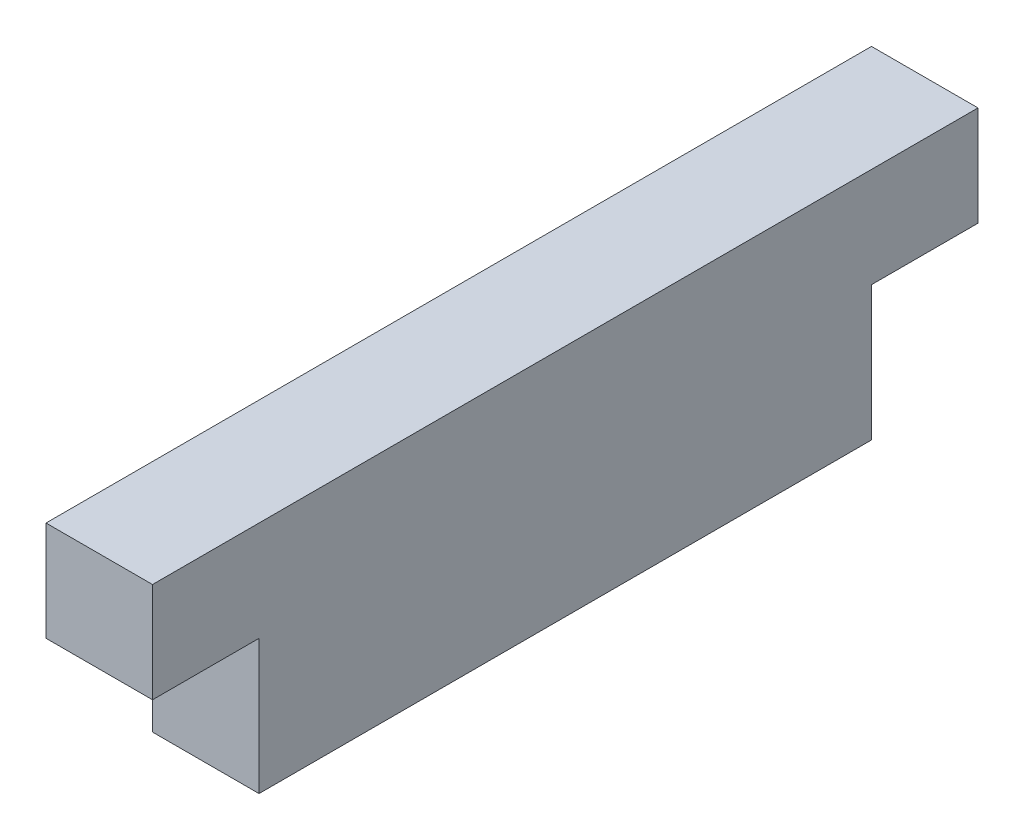
ISO-10303-21;
HEADER;
FILE_DESCRIPTION(('STEP AP214'),'2;1');
FILE_NAME('part.step','',(''),(''),'','','');
FILE_SCHEMA(('AUTOMOTIVE_DESIGN { 1 0 10303 214 1 1 1 1 }'));
ENDSEC;
DATA;
#1=APPLICATION_CONTEXT('core data for automotive mechanical design processes');
#2=APPLICATION_PROTOCOL_DEFINITION('international standard','automotive_design',2000,#1);
#3=PRODUCT_CONTEXT('',#1,'mechanical');
#4=PRODUCT('Part','Part','',(#3));
#5=PRODUCT_RELATED_PRODUCT_CATEGORY('part','',(#4));
#6=PRODUCT_DEFINITION_FORMATION('','',#4);
#7=PRODUCT_DEFINITION_CONTEXT('part definition',#1,'design');
#8=PRODUCT_DEFINITION('design','',#6,#7);
#9=PRODUCT_DEFINITION_SHAPE('','',#8);
#10=(LENGTH_UNIT() NAMED_UNIT(*) SI_UNIT(.MILLI.,.METRE.));
#11=(NAMED_UNIT(*) PLANE_ANGLE_UNIT() SI_UNIT($,.RADIAN.));
#12=(NAMED_UNIT(*) SI_UNIT($,.STERADIAN.) SOLID_ANGLE_UNIT());
#13=UNCERTAINTY_MEASURE_WITH_UNIT(LENGTH_MEASURE(1.E-05),#10,'distance_accuracy_value','');
#14=(GEOMETRIC_REPRESENTATION_CONTEXT(3) GLOBAL_UNCERTAINTY_ASSIGNED_CONTEXT((#13)) GLOBAL_UNIT_ASSIGNED_CONTEXT((#10,
#11,#12)) REPRESENTATION_CONTEXT('',''));
#15=CARTESIAN_POINT('',(0.,0.,0.));
#16=DIRECTION('',(0.,0.,1.));
#17=DIRECTION('',(1.,0.,0.));
#18=AXIS2_PLACEMENT_3D('',#15,#16,#17);
#19=CARTESIAN_POINT('',(5.08,-5.588,0.));
#20=DIRECTION('',(0.,1.,0.));
#21=DIRECTION('',(0.,0.,1.));
#22=AXIS2_PLACEMENT_3D('',#19,#20,#21);
#23=PLANE('',#22);
#24=DIRECTION('',(0.,0.,-1.));
#25=VECTOR('',#24,1.);
#26=CARTESIAN_POINT('',(0.,-5.588,0.));
#27=LINE('',#26,#25);
#28=CARTESIAN_POINT('',(0.,-5.588,14.605));
#29=VERTEX_POINT('',#28);
#30=CARTESIAN_POINT('',(0.,-5.588,-14.605));
#31=VERTEX_POINT('',#30);
#32=EDGE_CURVE('E160',#29,#31,#27,.T.);
#33=ORIENTED_EDGE('',*,*,#32,.T.);
#34=DIRECTION('',(-1.,0.,0.));
#35=VECTOR('',#34,1.);
#36=CARTESIAN_POINT('',(5.08,-5.588,-14.605));
#37=LINE('',#36,#35);
#38=CARTESIAN_POINT('',(5.08,-5.588,-14.605));
#39=VERTEX_POINT('',#38);
#40=EDGE_CURVE('E156',#39,#31,#37,.T.);
#41=ORIENTED_EDGE('',*,*,#40,.F.);
#42=DIRECTION('',(0.,0.,-1.));
#43=VECTOR('',#42,1.);
#44=CARTESIAN_POINT('',(5.08,-5.588,0.));
#45=LINE('',#44,#43);
#46=CARTESIAN_POINT('',(5.08,-5.588,14.605));
#47=VERTEX_POINT('',#46);
#48=EDGE_CURVE('E159',#47,#39,#45,.T.);
#49=ORIENTED_EDGE('',*,*,#48,.F.);
#50=DIRECTION('',(-1.,0.,0.));
#51=VECTOR('',#50,1.);
#52=CARTESIAN_POINT('',(5.08,-5.588,14.605));
#53=LINE('',#52,#51);
#54=EDGE_CURVE('E146',#47,#29,#53,.T.);
#55=ORIENTED_EDGE('',*,*,#54,.T.);
#56=EDGE_LOOP('',(#33,#41,#49,#55));
#57=FACE_BOUND('',#56,.T.);
#58=ADVANCED_FACE('F59',(#57),#23,.F.);
#59=CARTESIAN_POINT('',(0.,0.,0.));
#60=DIRECTION('',(1.,0.,0.));
#61=DIRECTION('',(0.,0.,-1.));
#62=AXIS2_PLACEMENT_3D('',#59,#60,#61);
#63=PLANE('',#62);
#64=DIRECTION('',(0.,0.,-1.));
#65=VECTOR('',#64,1.);
#66=CARTESIAN_POINT('',(0.,5.588,0.));
#67=LINE('',#66,#65);
#68=CARTESIAN_POINT('',(0.,5.588,19.685));
#69=VERTEX_POINT('',#68);
#70=CARTESIAN_POINT('',(0.,5.588,-19.685));
#71=VERTEX_POINT('',#70);
#72=EDGE_CURVE('E111',#69,#71,#67,.T.);
#73=ORIENTED_EDGE('',*,*,#72,.T.);
#74=DIRECTION('',(0.,-1.,0.));
#75=VECTOR('',#74,1.);
#76=CARTESIAN_POINT('',(0.,5.588,-19.685));
#77=LINE('',#76,#75);
#78=CARTESIAN_POINT('',(0.,0.825499999999997,-19.685));
#79=VERTEX_POINT('',#78);
#80=EDGE_CURVE('E115',#71,#79,#77,.T.);
#81=ORIENTED_EDGE('',*,*,#80,.T.);
#82=DIRECTION('',(0.,0.,-1.));
#83=VECTOR('',#82,1.);
#84=CARTESIAN_POINT('',(0.,0.825499999999997,-14.605));
#85=LINE('',#84,#83);
#86=CARTESIAN_POINT('',(0.,0.825499999999997,-14.605));
#87=VERTEX_POINT('',#86);
#88=EDGE_CURVE('E133',#87,#79,#85,.T.);
#89=ORIENTED_EDGE('',*,*,#88,.F.);
#90=DIRECTION('',(0.,-1.,0.));
#91=VECTOR('',#90,1.);
#92=CARTESIAN_POINT('',(0.,0.,-14.605));
#93=LINE('',#92,#91);
#94=EDGE_CURVE('E123',#87,#31,#93,.T.);
#95=ORIENTED_EDGE('',*,*,#94,.T.);
#96=ORIENTED_EDGE('',*,*,#32,.F.);
#97=DIRECTION('',(0.,-1.,0.));
#98=VECTOR('',#97,1.);
#99=CARTESIAN_POINT('',(0.,0.,14.605));
#100=LINE('',#99,#98);
#101=CARTESIAN_POINT('',(0.,0.825499999999997,14.605));
#102=VERTEX_POINT('',#101);
#103=EDGE_CURVE('E122',#102,#29,#100,.T.);
#104=ORIENTED_EDGE('',*,*,#103,.F.);
#105=DIRECTION('',(0.,0.,1.));
#106=VECTOR('',#105,1.);
#107=CARTESIAN_POINT('',(0.,0.825499999999997,14.605));
#108=LINE('',#107,#106);
#109=CARTESIAN_POINT('',(0.,0.825499999999997,19.685));
#110=VERTEX_POINT('',#109);
#111=EDGE_CURVE('E149',#102,#110,#108,.T.);
#112=ORIENTED_EDGE('',*,*,#111,.T.);
#113=DIRECTION('',(0.,-1.,0.));
#114=VECTOR('',#113,1.);
#115=CARTESIAN_POINT('',(0.,5.588,19.685));
#116=LINE('',#115,#114);
#117=EDGE_CURVE('E118',#69,#110,#116,.T.);
#118=ORIENTED_EDGE('',*,*,#117,.F.);
#119=EDGE_LOOP('',(#73,#81,#89,#95,#96,#104,#112,#118));
#120=FACE_BOUND('',#119,.T.);
#121=ADVANCED_FACE('F113',(#120),#63,.F.);
#122=CARTESIAN_POINT('',(5.08,0.,0.));
#123=DIRECTION('',(1.,0.,0.));
#124=DIRECTION('',(0.,0.,-1.));
#125=AXIS2_PLACEMENT_3D('',#122,#123,#124);
#126=PLANE('',#125);
#127=DIRECTION('',(0.,-1.,0.));
#128=VECTOR('',#127,1.);
#129=CARTESIAN_POINT('',(5.08,0.,-14.605));
#130=LINE('',#129,#128);
#131=CARTESIAN_POINT('',(5.08,0.825499999999997,-14.605));
#132=VERTEX_POINT('',#131);
#133=EDGE_CURVE('E163',#132,#39,#130,.T.);
#134=ORIENTED_EDGE('',*,*,#133,.F.);
#135=DIRECTION('',(0.,0.,-1.));
#136=VECTOR('',#135,1.);
#137=CARTESIAN_POINT('',(5.08,0.825499999999997,-14.605));
#138=LINE('',#137,#136);
#139=CARTESIAN_POINT('',(5.08,0.825499999999997,-19.685));
#140=VERTEX_POINT('',#139);
#141=EDGE_CURVE('E132',#132,#140,#138,.T.);
#142=ORIENTED_EDGE('',*,*,#141,.T.);
#143=DIRECTION('',(0.,-1.,0.));
#144=VECTOR('',#143,1.);
#145=CARTESIAN_POINT('',(5.08,5.588,-19.685));
#146=LINE('',#145,#144);
#147=CARTESIAN_POINT('',(5.08,5.588,-19.685));
#148=VERTEX_POINT('',#147);
#149=EDGE_CURVE('E130',#148,#140,#146,.T.);
#150=ORIENTED_EDGE('',*,*,#149,.F.);
#151=DIRECTION('',(0.,0.,-1.));
#152=VECTOR('',#151,1.);
#153=CARTESIAN_POINT('',(5.08,5.588,0.));
#154=LINE('',#153,#152);
#155=CARTESIAN_POINT('',(5.08,5.588,19.685));
#156=VERTEX_POINT('',#155);
#157=EDGE_CURVE('E128',#156,#148,#154,.T.);
#158=ORIENTED_EDGE('',*,*,#157,.F.);
#159=DIRECTION('',(0.,-1.,0.));
#160=VECTOR('',#159,1.);
#161=CARTESIAN_POINT('',(5.08,5.588,19.685));
#162=LINE('',#161,#160);
#163=CARTESIAN_POINT('',(5.08,0.825499999999997,19.685));
#164=VERTEX_POINT('',#163);
#165=EDGE_CURVE('E142',#156,#164,#162,.T.);
#166=ORIENTED_EDGE('',*,*,#165,.T.);
#167=DIRECTION('',(0.,0.,1.));
#168=VECTOR('',#167,1.);
#169=CARTESIAN_POINT('',(5.08,0.825499999999997,14.605));
#170=LINE('',#169,#168);
#171=CARTESIAN_POINT('',(5.08,0.825499999999997,14.605));
#172=VERTEX_POINT('',#171);
#173=EDGE_CURVE('E148',#172,#164,#170,.T.);
#174=ORIENTED_EDGE('',*,*,#173,.F.);
#175=DIRECTION('',(0.,-1.,0.));
#176=VECTOR('',#175,1.);
#177=CARTESIAN_POINT('',(5.08,0.,14.605));
#178=LINE('',#177,#176);
#179=EDGE_CURVE('E170',#172,#47,#178,.T.);
#180=ORIENTED_EDGE('',*,*,#179,.T.);
#181=ORIENTED_EDGE('',*,*,#48,.T.);
#182=EDGE_LOOP('',(#134,#142,#150,#158,#166,#174,#180,#181));
#183=FACE_BOUND('',#182,.T.);
#184=ADVANCED_FACE('F184',(#183),#126,.T.);
#185=CARTESIAN_POINT('',(5.08,0.,14.605));
#186=DIRECTION('',(0.,0.,-1.));
#187=DIRECTION('',(-1.,0.,0.));
#188=AXIS2_PLACEMENT_3D('',#185,#186,#187);
#189=PLANE('',#188);
#190=ORIENTED_EDGE('',*,*,#179,.F.);
#191=DIRECTION('',(-1.,0.,0.));
#192=VECTOR('',#191,1.);
#193=CARTESIAN_POINT('',(5.08,0.825499999999997,14.605));
#194=LINE('',#193,#192);
#195=EDGE_CURVE('E69',#172,#102,#194,.T.);
#196=ORIENTED_EDGE('',*,*,#195,.T.);
#197=ORIENTED_EDGE('',*,*,#103,.T.);
#198=ORIENTED_EDGE('',*,*,#54,.F.);
#199=EDGE_LOOP('',(#190,#196,#197,#198));
#200=FACE_BOUND('',#199,.T.);
#201=ADVANCED_FACE('F202',(#200),#189,.F.);
#202=CARTESIAN_POINT('',(5.08,0.,-14.605));
#203=DIRECTION('',(0.,0.,-1.));
#204=DIRECTION('',(-1.,0.,0.));
#205=AXIS2_PLACEMENT_3D('',#202,#203,#204);
#206=PLANE('',#205);
#207=DIRECTION('',(-1.,0.,0.));
#208=VECTOR('',#207,1.);
#209=CARTESIAN_POINT('',(5.08,0.825499999999997,-14.605));
#210=LINE('',#209,#208);
#211=EDGE_CURVE('E12',#132,#87,#210,.T.);
#212=ORIENTED_EDGE('',*,*,#211,.F.);
#213=ORIENTED_EDGE('',*,*,#133,.T.);
#214=ORIENTED_EDGE('',*,*,#40,.T.);
#215=ORIENTED_EDGE('',*,*,#94,.F.);
#216=EDGE_LOOP('',(#212,#213,#214,#215));
#217=FACE_BOUND('',#216,.T.);
#218=ADVANCED_FACE('F176',(#217),#206,.T.);
#219=CARTESIAN_POINT('',(5.08,5.588,0.));
#220=DIRECTION('',(0.,1.,0.));
#221=DIRECTION('',(0.,0.,1.));
#222=AXIS2_PLACEMENT_3D('',#219,#220,#221);
#223=PLANE('',#222);
#224=ORIENTED_EDGE('',*,*,#72,.F.);
#225=DIRECTION('',(-1.,0.,0.));
#226=VECTOR('',#225,1.);
#227=CARTESIAN_POINT('',(5.08,5.588,19.685));
#228=LINE('',#227,#226);
#229=EDGE_CURVE('E141',#156,#69,#228,.T.);
#230=ORIENTED_EDGE('',*,*,#229,.F.);
#231=ORIENTED_EDGE('',*,*,#157,.T.);
#232=DIRECTION('',(-1.,0.,0.));
#233=VECTOR('',#232,1.);
#234=CARTESIAN_POINT('',(5.08,5.588,-19.685));
#235=LINE('',#234,#233);
#236=EDGE_CURVE('E126',#148,#71,#235,.T.);
#237=ORIENTED_EDGE('',*,*,#236,.T.);
#238=EDGE_LOOP('',(#224,#230,#231,#237));
#239=FACE_BOUND('',#238,.T.);
#240=ADVANCED_FACE('F127',(#239),#223,.T.);
#241=CARTESIAN_POINT('',(5.08,5.588,19.685));
#242=DIRECTION('',(0.,0.,-1.));
#243=DIRECTION('',(-1.,0.,0.));
#244=AXIS2_PLACEMENT_3D('',#241,#242,#243);
#245=PLANE('',#244);
#246=ORIENTED_EDGE('',*,*,#117,.T.);
#247=DIRECTION('',(-1.,0.,0.));
#248=VECTOR('',#247,1.);
#249=CARTESIAN_POINT('',(5.08,0.825499999999997,19.685));
#250=LINE('',#249,#248);
#251=EDGE_CURVE('E139',#164,#110,#250,.T.);
#252=ORIENTED_EDGE('',*,*,#251,.F.);
#253=ORIENTED_EDGE('',*,*,#165,.F.);
#254=ORIENTED_EDGE('',*,*,#229,.T.);
#255=EDGE_LOOP('',(#246,#252,#253,#254));
#256=FACE_BOUND('',#255,.T.);
#257=ADVANCED_FACE('F246',(#256),#245,.F.);
#258=CARTESIAN_POINT('',(5.08,0.825499999999997,14.605));
#259=DIRECTION('',(0.,-1.,0.));
#260=DIRECTION('',(0.,0.,-1.));
#261=AXIS2_PLACEMENT_3D('',#258,#259,#260);
#262=PLANE('',#261);
#263=ORIENTED_EDGE('',*,*,#111,.F.);
#264=ORIENTED_EDGE('',*,*,#195,.F.);
#265=ORIENTED_EDGE('',*,*,#173,.T.);
#266=ORIENTED_EDGE('',*,*,#251,.T.);
#267=EDGE_LOOP('',(#263,#264,#265,#266));
#268=FACE_BOUND('',#267,.T.);
#269=ADVANCED_FACE('F199',(#268),#262,.T.);
#270=CARTESIAN_POINT('',(5.08,5.588,-19.685));
#271=DIRECTION('',(0.,0.,-1.));
#272=DIRECTION('',(-1.,0.,0.));
#273=AXIS2_PLACEMENT_3D('',#270,#271,#272);
#274=PLANE('',#273);
#275=ORIENTED_EDGE('',*,*,#80,.F.);
#276=ORIENTED_EDGE('',*,*,#236,.F.);
#277=ORIENTED_EDGE('',*,*,#149,.T.);
#278=DIRECTION('',(-1.,0.,0.));
#279=VECTOR('',#278,1.);
#280=CARTESIAN_POINT('',(5.08,0.825499999999997,-19.685));
#281=LINE('',#280,#279);
#282=EDGE_CURVE('E63',#140,#79,#281,.T.);
#283=ORIENTED_EDGE('',*,*,#282,.T.);
#284=EDGE_LOOP('',(#275,#276,#277,#283));
#285=FACE_BOUND('',#284,.T.);
#286=ADVANCED_FACE('F131',(#285),#274,.T.);
#287=CARTESIAN_POINT('',(5.08,0.825499999999997,-14.605));
#288=DIRECTION('',(0.,1.,0.));
#289=DIRECTION('',(0.,0.,1.));
#290=AXIS2_PLACEMENT_3D('',#287,#288,#289);
#291=PLANE('',#290);
#292=ORIENTED_EDGE('',*,*,#88,.T.);
#293=ORIENTED_EDGE('',*,*,#282,.F.);
#294=ORIENTED_EDGE('',*,*,#141,.F.);
#295=ORIENTED_EDGE('',*,*,#211,.T.);
#296=EDGE_LOOP('',(#292,#293,#294,#295));
#297=FACE_BOUND('',#296,.T.);
#298=ADVANCED_FACE('F61',(#297),#291,.F.);
#299=CLOSED_SHELL('',(#58,#121,#184,#201,#218,#240,#257,#269,#286,#298));
#300=MANIFOLD_SOLID_BREP('B2',#299);
#301=ADVANCED_BREP_SHAPE_REPRESENTATION('',(#18,#300),#14);
#302=SHAPE_DEFINITION_REPRESENTATION(#9,#301);
ENDSEC;
END-ISO-10303-21;
